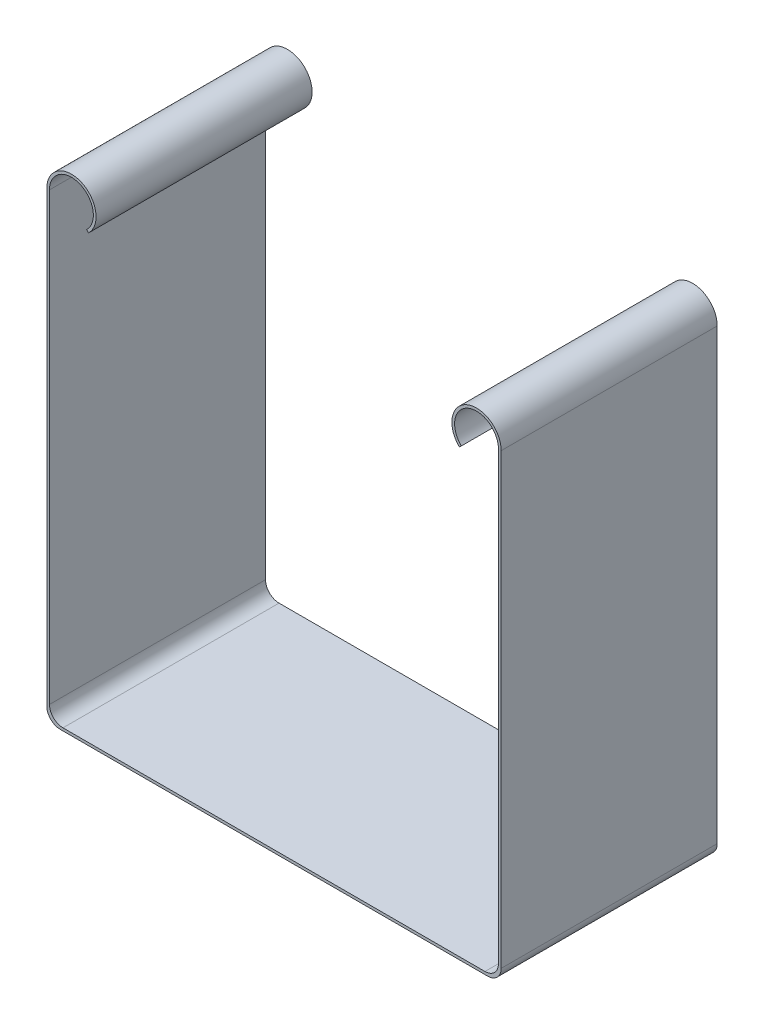
ISO-10303-21;
HEADER;
FILE_DESCRIPTION(('STEP AP214'),'2;1');
FILE_NAME('part.step','',(''),(''),'','','');
FILE_SCHEMA(('AUTOMOTIVE_DESIGN { 1 0 10303 214 1 1 1 1 }'));
ENDSEC;
DATA;
#1=APPLICATION_CONTEXT('core data for automotive mechanical design processes');
#2=APPLICATION_PROTOCOL_DEFINITION('international standard','automotive_design',2000,#1);
#3=PRODUCT_CONTEXT('',#1,'mechanical');
#4=PRODUCT('Part','Part','',(#3));
#5=PRODUCT_RELATED_PRODUCT_CATEGORY('part','',(#4));
#6=PRODUCT_DEFINITION_FORMATION('','',#4);
#7=PRODUCT_DEFINITION_CONTEXT('part definition',#1,'design');
#8=PRODUCT_DEFINITION('design','',#6,#7);
#9=PRODUCT_DEFINITION_SHAPE('','',#8);
#10=(LENGTH_UNIT() NAMED_UNIT(*) SI_UNIT(.MILLI.,.METRE.));
#11=(NAMED_UNIT(*) PLANE_ANGLE_UNIT() SI_UNIT($,.RADIAN.));
#12=(NAMED_UNIT(*) SI_UNIT($,.STERADIAN.) SOLID_ANGLE_UNIT());
#13=UNCERTAINTY_MEASURE_WITH_UNIT(LENGTH_MEASURE(1.E-05),#10,'distance_accuracy_value','');
#14=(GEOMETRIC_REPRESENTATION_CONTEXT(3) GLOBAL_UNCERTAINTY_ASSIGNED_CONTEXT((#13)) GLOBAL_UNIT_ASSIGNED_CONTEXT((#10,
#11,#12)) REPRESENTATION_CONTEXT('',''));
#15=CARTESIAN_POINT('',(0.,0.,0.));
#16=DIRECTION('',(0.,0.,1.));
#17=DIRECTION('',(1.,0.,0.));
#18=AXIS2_PLACEMENT_3D('',#15,#16,#17);
#19=CARTESIAN_POINT('',(33.65,-0.4,32.));
#20=DIRECTION('',(0.,1.,0.));
#21=DIRECTION('',(-1.,0.,0.));
#22=AXIS2_PLACEMENT_3D('',#19,#20,#21);
#23=PLANE('',#22);
#24=DIRECTION('',(1.,0.,0.));
#25=VECTOR('',#24,1.);
#26=CARTESIAN_POINT('',(33.65,-0.4,0.));
#27=LINE('',#26,#25);
#28=CARTESIAN_POINT('',(-31.65,-0.400000000000008,0.));
#29=VERTEX_POINT('',#28);
#30=CARTESIAN_POINT('',(31.65,-0.4,0.));
#31=VERTEX_POINT('',#30);
#32=EDGE_CURVE('E218',#29,#31,#27,.T.);
#33=ORIENTED_EDGE('',*,*,#32,.T.);
#34=DIRECTION('',(0.,0.,-1.));
#35=VECTOR('',#34,1.);
#36=CARTESIAN_POINT('',(31.65,-0.4,32.));
#37=LINE('',#36,#35);
#38=CARTESIAN_POINT('',(31.65,-0.4,32.));
#39=VERTEX_POINT('',#38);
#40=EDGE_CURVE('E48',#31,#39,#37,.F.);
#41=ORIENTED_EDGE('',*,*,#40,.T.);
#42=DIRECTION('',(1.,0.,0.));
#43=VECTOR('',#42,1.);
#44=CARTESIAN_POINT('',(33.65,-0.4,32.));
#45=LINE('',#44,#43);
#46=CARTESIAN_POINT('',(-31.65,-0.400000000000008,32.));
#47=VERTEX_POINT('',#46);
#48=EDGE_CURVE('E219',#47,#39,#45,.T.);
#49=ORIENTED_EDGE('',*,*,#48,.F.);
#50=DIRECTION('',(0.,0.,-1.));
#51=VECTOR('',#50,1.);
#52=CARTESIAN_POINT('',(-31.65,-0.400000000000008,32.));
#53=LINE('',#52,#51);
#54=EDGE_CURVE('E205',#29,#47,#53,.F.);
#55=ORIENTED_EDGE('',*,*,#54,.F.);
#56=EDGE_LOOP('',(#33,#41,#49,#55));
#57=FACE_BOUND('',#56,.T.);
#58=ADVANCED_FACE('F33',(#57),#23,.F.);
#59=CARTESIAN_POINT('',(33.65,68.,32.));
#60=DIRECTION('',(-1.,0.,0.));
#61=DIRECTION('',(0.,0.,1.));
#62=AXIS2_PLACEMENT_3D('',#59,#60,#61);
#63=PLANE('',#62);
#64=DIRECTION('',(0.,1.,0.));
#65=VECTOR('',#64,1.);
#66=CARTESIAN_POINT('',(33.65,34.,32.));
#67=LINE('',#66,#65);
#68=CARTESIAN_POINT('',(33.65,1.6,32.));
#69=VERTEX_POINT('',#68);
#70=CARTESIAN_POINT('',(33.65,68.,32.));
#71=VERTEX_POINT('',#70);
#72=EDGE_CURVE('E221',#69,#71,#67,.T.);
#73=ORIENTED_EDGE('',*,*,#72,.F.);
#74=DIRECTION('',(0.,0.,-1.));
#75=VECTOR('',#74,1.);
#76=CARTESIAN_POINT('',(33.65,1.6,32.));
#77=LINE('',#76,#75);
#78=CARTESIAN_POINT('',(33.65,1.6,0.));
#79=VERTEX_POINT('',#78);
#80=EDGE_CURVE('E266',#69,#79,#77,.T.);
#81=ORIENTED_EDGE('',*,*,#80,.T.);
#82=DIRECTION('',(0.,1.,0.));
#83=VECTOR('',#82,1.);
#84=CARTESIAN_POINT('',(33.65,68.,0.));
#85=LINE('',#84,#83);
#86=CARTESIAN_POINT('',(33.65,68.,0.));
#87=VERTEX_POINT('',#86);
#88=EDGE_CURVE('E237',#79,#87,#85,.T.);
#89=ORIENTED_EDGE('',*,*,#88,.T.);
#90=DIRECTION('',(0.,0.,-1.));
#91=VECTOR('',#90,1.);
#92=CARTESIAN_POINT('',(33.65,68.,32.));
#93=LINE('',#92,#91);
#94=EDGE_CURVE('E258',#71,#87,#93,.T.);
#95=ORIENTED_EDGE('',*,*,#94,.F.);
#96=EDGE_LOOP('',(#73,#81,#89,#95));
#97=FACE_BOUND('',#96,.T.);
#98=ADVANCED_FACE('F306',(#97),#63,.F.);
#99=CARTESIAN_POINT('',(30.,68.,32.));
#100=DIRECTION('',(0.,0.,-1.));
#101=DIRECTION('',(-1.,0.,0.));
#102=AXIS2_PLACEMENT_3D('',#99,#100,#101);
#103=CYLINDRICAL_SURFACE('',#102,3.64999999999999);
#104=CARTESIAN_POINT('',(30.,68.,0.));
#105=DIRECTION('',(0.,0.,1.));
#106=DIRECTION('',(1.,0.,0.));
#107=AXIS2_PLACEMENT_3D('',#104,#105,#106);
#108=CIRCLE('',#107,3.64999999999999);
#109=CARTESIAN_POINT('',(27.4671032395295,65.3718953596178,0.));
#110=VERTEX_POINT('',#109);
#111=EDGE_CURVE('E239',#87,#110,#108,.T.);
#112=ORIENTED_EDGE('',*,*,#111,.T.);
#113=DIRECTION('',(0.,0.,-1.));
#114=VECTOR('',#113,1.);
#115=CARTESIAN_POINT('',(27.4671032395295,65.3718953596178,32.));
#116=LINE('',#115,#114);
#117=CARTESIAN_POINT('',(27.4671032395295,65.3718953596178,32.));
#118=VERTEX_POINT('',#117);
#119=EDGE_CURVE('E255',#118,#110,#116,.T.);
#120=ORIENTED_EDGE('',*,*,#119,.F.);
#121=CARTESIAN_POINT('',(30.,68.,32.));
#122=DIRECTION('',(0.,0.,1.));
#123=DIRECTION('',(1.,0.,0.));
#124=AXIS2_PLACEMENT_3D('',#121,#122,#123);
#125=CIRCLE('',#124,3.64999999999999);
#126=EDGE_CURVE('E224',#71,#118,#125,.T.);
#127=ORIENTED_EDGE('',*,*,#126,.F.);
#128=ORIENTED_EDGE('',*,*,#94,.T.);
#129=EDGE_LOOP('',(#112,#120,#127,#128));
#130=FACE_BOUND('',#129,.T.);
#131=ADVANCED_FACE('F302',(#130),#103,.T.);
#132=CARTESIAN_POINT('',(27.75,65.6547921200883,32.));
#133=DIRECTION('',(-0.707106781186561,0.707106781186535,0.));
#134=DIRECTION('',(-0.707106781186535,-0.707106781186561,0.));
#135=AXIS2_PLACEMENT_3D('',#132,#133,#134);
#136=PLANE('',#135);
#137=DIRECTION('',(0.707106781186534,0.70710678118656,0.));
#138=VECTOR('',#137,1.);
#139=CARTESIAN_POINT('',(27.75,65.6547921200883,0.));
#140=LINE('',#139,#138);
#141=CARTESIAN_POINT('',(27.75,65.6547921200883,0.));
#142=VERTEX_POINT('',#141);
#143=EDGE_CURVE('E241',#110,#142,#140,.T.);
#144=ORIENTED_EDGE('',*,*,#143,.T.);
#145=DIRECTION('',(0.,0.,-1.));
#146=VECTOR('',#145,1.);
#147=CARTESIAN_POINT('',(27.75,65.6547921200883,32.));
#148=LINE('',#147,#146);
#149=CARTESIAN_POINT('',(27.75,65.6547921200883,32.));
#150=VERTEX_POINT('',#149);
#151=EDGE_CURVE('E252',#150,#142,#148,.T.);
#152=ORIENTED_EDGE('',*,*,#151,.F.);
#153=DIRECTION('',(0.707106781186534,0.70710678118656,0.));
#154=VECTOR('',#153,1.);
#155=CARTESIAN_POINT('',(27.75,65.6547921200883,32.));
#156=LINE('',#155,#154);
#157=EDGE_CURVE('E226',#118,#150,#156,.T.);
#158=ORIENTED_EDGE('',*,*,#157,.F.);
#159=ORIENTED_EDGE('',*,*,#119,.T.);
#160=EDGE_LOOP('',(#144,#152,#158,#159));
#161=FACE_BOUND('',#160,.T.);
#162=ADVANCED_FACE('F297',(#161),#136,.F.);
#163=CARTESIAN_POINT('',(30.,68.,32.));
#164=DIRECTION('',(0.,0.,-1.));
#165=DIRECTION('',(-1.,0.,0.));
#166=AXIS2_PLACEMENT_3D('',#163,#164,#165);
#167=CYLINDRICAL_SURFACE('',#166,3.24999999999999);
#168=CARTESIAN_POINT('',(30.,68.,0.));
#169=DIRECTION('',(0.,0.,-1.));
#170=DIRECTION('',(1.,0.,0.));
#171=AXIS2_PLACEMENT_3D('',#168,#169,#170);
#172=CIRCLE('',#171,3.24999999999999);
#173=CARTESIAN_POINT('',(33.25,68.,0.));
#174=VERTEX_POINT('',#173);
#175=EDGE_CURVE('E243',#142,#174,#172,.T.);
#176=ORIENTED_EDGE('',*,*,#175,.T.);
#177=DIRECTION('',(0.,0.,-1.));
#178=VECTOR('',#177,1.);
#179=CARTESIAN_POINT('',(33.25,68.,32.));
#180=LINE('',#179,#178);
#181=CARTESIAN_POINT('',(33.25,68.,32.));
#182=VERTEX_POINT('',#181);
#183=EDGE_CURVE('E235',#182,#174,#180,.T.);
#184=ORIENTED_EDGE('',*,*,#183,.F.);
#185=CARTESIAN_POINT('',(30.,68.,32.));
#186=DIRECTION('',(0.,0.,-1.));
#187=DIRECTION('',(1.,0.,0.));
#188=AXIS2_PLACEMENT_3D('',#185,#186,#187);
#189=CIRCLE('',#188,3.24999999999999);
#190=EDGE_CURVE('E228',#150,#182,#189,.T.);
#191=ORIENTED_EDGE('',*,*,#190,.F.);
#192=ORIENTED_EDGE('',*,*,#151,.T.);
#193=EDGE_LOOP('',(#176,#184,#191,#192));
#194=FACE_BOUND('',#193,.T.);
#195=ADVANCED_FACE('F292',(#194),#167,.F.);
#196=CARTESIAN_POINT('',(33.25,34.,32.));
#197=DIRECTION('',(1.,0.,0.));
#198=DIRECTION('',(0.,0.,-1.));
#199=AXIS2_PLACEMENT_3D('',#196,#197,#198);
#200=PLANE('',#199);
#201=DIRECTION('',(0.,-1.,0.));
#202=VECTOR('',#201,1.);
#203=CARTESIAN_POINT('',(33.25,34.,0.));
#204=LINE('',#203,#202);
#205=CARTESIAN_POINT('',(33.25,2.,0.));
#206=VERTEX_POINT('',#205);
#207=EDGE_CURVE('E246',#174,#206,#204,.T.);
#208=ORIENTED_EDGE('',*,*,#207,.T.);
#209=DIRECTION('',(0.,0.,-1.));
#210=VECTOR('',#209,1.);
#211=CARTESIAN_POINT('',(33.25,2.,32.));
#212=LINE('',#211,#210);
#213=CARTESIAN_POINT('',(33.25,2.,32.));
#214=VERTEX_POINT('',#213);
#215=EDGE_CURVE('E264',#206,#214,#212,.F.);
#216=ORIENTED_EDGE('',*,*,#215,.T.);
#217=DIRECTION('',(0.,-1.,0.));
#218=VECTOR('',#217,1.);
#219=CARTESIAN_POINT('',(33.25,68.,32.));
#220=LINE('',#219,#218);
#221=EDGE_CURVE('E230',#182,#214,#220,.T.);
#222=ORIENTED_EDGE('',*,*,#221,.F.);
#223=ORIENTED_EDGE('',*,*,#183,.T.);
#224=EDGE_LOOP('',(#208,#216,#222,#223));
#225=FACE_BOUND('',#224,.T.);
#226=ADVANCED_FACE('F288',(#225),#200,.F.);
#227=CARTESIAN_POINT('',(33.25,0.,32.));
#228=DIRECTION('',(0.,-1.,0.));
#229=DIRECTION('',(0.,0.,-1.));
#230=AXIS2_PLACEMENT_3D('',#227,#228,#229);
#231=PLANE('',#230);
#232=DIRECTION('',(-1.,0.,0.));
#233=VECTOR('',#232,1.);
#234=CARTESIAN_POINT('',(33.25,0.,32.));
#235=LINE('',#234,#233);
#236=CARTESIAN_POINT('',(31.25,0.,32.));
#237=VERTEX_POINT('',#236);
#238=CARTESIAN_POINT('',(-31.25,0.,32.));
#239=VERTEX_POINT('',#238);
#240=EDGE_CURVE('E233',#237,#239,#235,.T.);
#241=ORIENTED_EDGE('',*,*,#240,.F.);
#242=DIRECTION('',(0.,0.,-1.));
#243=VECTOR('',#242,1.);
#244=CARTESIAN_POINT('',(31.25,0.,0.));
#245=LINE('',#244,#243);
#246=CARTESIAN_POINT('',(31.25,0.,0.));
#247=VERTEX_POINT('',#246);
#248=EDGE_CURVE('E261',#237,#247,#245,.T.);
#249=ORIENTED_EDGE('',*,*,#248,.T.);
#250=DIRECTION('',(-1.,0.,0.));
#251=VECTOR('',#250,1.);
#252=CARTESIAN_POINT('',(33.25,0.,0.));
#253=LINE('',#252,#251);
#254=CARTESIAN_POINT('',(-31.25,0.,0.));
#255=VERTEX_POINT('',#254);
#256=EDGE_CURVE('E222',#247,#255,#253,.T.);
#257=ORIENTED_EDGE('',*,*,#256,.T.);
#258=DIRECTION('',(0.,0.,-1.));
#259=VECTOR('',#258,1.);
#260=CARTESIAN_POINT('',(-31.25,0.,0.));
#261=LINE('',#260,#259);
#262=EDGE_CURVE('E164',#239,#255,#261,.T.);
#263=ORIENTED_EDGE('',*,*,#262,.F.);
#264=EDGE_LOOP('',(#241,#249,#257,#263));
#265=FACE_BOUND('',#264,.T.);
#266=ADVANCED_FACE('F281',(#265),#231,.F.);
#267=CARTESIAN_POINT('',(30.,68.,32.));
#268=DIRECTION('',(0.,0.,1.));
#269=DIRECTION('',(1.,0.,0.));
#270=AXIS2_PLACEMENT_3D('',#267,#268,#269);
#271=PLANE('',#270);
#272=ORIENTED_EDGE('',*,*,#48,.T.);
#273=CARTESIAN_POINT('',(31.65,1.6,32.));
#274=DIRECTION('',(0.,0.,1.));
#275=DIRECTION('',(1.,0.,0.));
#276=AXIS2_PLACEMENT_3D('',#273,#274,#275);
#277=CIRCLE('',#276,2.);
#278=EDGE_CURVE('E11',#39,#69,#277,.T.);
#279=ORIENTED_EDGE('',*,*,#278,.T.);
#280=ORIENTED_EDGE('',*,*,#72,.T.);
#281=ORIENTED_EDGE('',*,*,#126,.T.);
#282=ORIENTED_EDGE('',*,*,#157,.T.);
#283=ORIENTED_EDGE('',*,*,#190,.T.);
#284=ORIENTED_EDGE('',*,*,#221,.T.);
#285=CARTESIAN_POINT('',(31.25,2.,32.));
#286=DIRECTION('',(0.,0.,1.));
#287=DIRECTION('',(1.,0.,0.));
#288=AXIS2_PLACEMENT_3D('',#285,#286,#287);
#289=CIRCLE('',#288,2.);
#290=EDGE_CURVE('E272',#214,#237,#289,.F.);
#291=ORIENTED_EDGE('',*,*,#290,.T.);
#292=ORIENTED_EDGE('',*,*,#240,.T.);
#293=CARTESIAN_POINT('',(-31.25,1.99999999999999,32.));
#294=DIRECTION('',(0.,0.,-1.));
#295=DIRECTION('',(-1.,0.,0.));
#296=AXIS2_PLACEMENT_3D('',#293,#294,#295);
#297=CIRCLE('',#296,2.);
#298=CARTESIAN_POINT('',(-33.25,1.99999999999999,32.));
#299=VERTEX_POINT('',#298);
#300=EDGE_CURVE('E210',#299,#239,#297,.F.);
#301=ORIENTED_EDGE('',*,*,#300,.F.);
#302=DIRECTION('',(0.,-1.,0.));
#303=VECTOR('',#302,1.);
#304=CARTESIAN_POINT('',(-33.25,68.,32.));
#305=LINE('',#304,#303);
#306=CARTESIAN_POINT('',(-33.25,68.,32.));
#307=VERTEX_POINT('',#306);
#308=EDGE_CURVE('E181',#307,#299,#305,.T.);
#309=ORIENTED_EDGE('',*,*,#308,.F.);
#310=CARTESIAN_POINT('',(-30.,68.,32.));
#311=DIRECTION('',(0.,0.,1.));
#312=DIRECTION('',(-1.,0.,0.));
#313=AXIS2_PLACEMENT_3D('',#310,#311,#312);
#314=CIRCLE('',#313,3.24999999999999);
#315=CARTESIAN_POINT('',(-27.75,65.6547921200883,32.));
#316=VERTEX_POINT('',#315);
#317=EDGE_CURVE('E178',#316,#307,#314,.T.);
#318=ORIENTED_EDGE('',*,*,#317,.F.);
#319=DIRECTION('',(-0.707106781186535,0.70710678118656,0.));
#320=VECTOR('',#319,1.);
#321=CARTESIAN_POINT('',(-27.75,65.6547921200883,32.));
#322=LINE('',#321,#320);
#323=CARTESIAN_POINT('',(-27.4671032395296,65.3718953596178,32.));
#324=VERTEX_POINT('',#323);
#325=EDGE_CURVE('E151',#324,#316,#322,.T.);
#326=ORIENTED_EDGE('',*,*,#325,.F.);
#327=CARTESIAN_POINT('',(-30.,68.,32.));
#328=DIRECTION('',(0.,0.,-1.));
#329=DIRECTION('',(-1.,0.,0.));
#330=AXIS2_PLACEMENT_3D('',#327,#328,#329);
#331=CIRCLE('',#330,3.64999999999999);
#332=CARTESIAN_POINT('',(-33.65,68.,32.));
#333=VERTEX_POINT('',#332);
#334=EDGE_CURVE('E144',#333,#324,#331,.T.);
#335=ORIENTED_EDGE('',*,*,#334,.F.);
#336=DIRECTION('',(0.,1.,0.));
#337=VECTOR('',#336,1.);
#338=CARTESIAN_POINT('',(-33.65,34.,32.));
#339=LINE('',#338,#337);
#340=CARTESIAN_POINT('',(-33.65,1.6,32.));
#341=VERTEX_POINT('',#340);
#342=EDGE_CURVE('E149',#341,#333,#339,.T.);
#343=ORIENTED_EDGE('',*,*,#342,.F.);
#344=CARTESIAN_POINT('',(-31.65,1.6,32.));
#345=DIRECTION('',(0.,0.,-1.));
#346=DIRECTION('',(-1.,0.,0.));
#347=AXIS2_PLACEMENT_3D('',#344,#345,#346);
#348=CIRCLE('',#347,2.);
#349=EDGE_CURVE('E216',#47,#341,#348,.T.);
#350=ORIENTED_EDGE('',*,*,#349,.F.);
#351=EDGE_LOOP('',(#272,#279,#280,#281,#282,#283,#284,#291,#292,#301,#309,#318,#326,#335,#343,#350));
#352=FACE_BOUND('',#351,.T.);
#353=ADVANCED_FACE('F146',(#352),#271,.T.);
#354=CARTESIAN_POINT('',(30.,68.,0.));
#355=DIRECTION('',(0.,0.,1.));
#356=DIRECTION('',(1.,0.,0.));
#357=AXIS2_PLACEMENT_3D('',#354,#355,#356);
#358=PLANE('',#357);
#359=ORIENTED_EDGE('',*,*,#88,.F.);
#360=CARTESIAN_POINT('',(31.65,1.6,0.));
#361=DIRECTION('',(0.,0.,1.));
#362=DIRECTION('',(1.,0.,0.));
#363=AXIS2_PLACEMENT_3D('',#360,#361,#362);
#364=CIRCLE('',#363,2.);
#365=EDGE_CURVE('E41',#79,#31,#364,.F.);
#366=ORIENTED_EDGE('',*,*,#365,.T.);
#367=ORIENTED_EDGE('',*,*,#32,.F.);
#368=CARTESIAN_POINT('',(-31.65,1.6,0.));
#369=DIRECTION('',(0.,0.,-1.));
#370=DIRECTION('',(-1.,0.,0.));
#371=AXIS2_PLACEMENT_3D('',#368,#369,#370);
#372=CIRCLE('',#371,2.);
#373=CARTESIAN_POINT('',(-33.65,1.6,0.));
#374=VERTEX_POINT('',#373);
#375=EDGE_CURVE('E213',#374,#29,#372,.F.);
#376=ORIENTED_EDGE('',*,*,#375,.F.);
#377=DIRECTION('',(0.,1.,0.));
#378=VECTOR('',#377,1.);
#379=CARTESIAN_POINT('',(-33.65,68.,0.));
#380=LINE('',#379,#378);
#381=CARTESIAN_POINT('',(-33.65,68.,0.));
#382=VERTEX_POINT('',#381);
#383=EDGE_CURVE('E185',#374,#382,#380,.T.);
#384=ORIENTED_EDGE('',*,*,#383,.T.);
#385=CARTESIAN_POINT('',(-30.,68.,0.));
#386=DIRECTION('',(0.,0.,-1.));
#387=DIRECTION('',(-1.,0.,0.));
#388=AXIS2_PLACEMENT_3D('',#385,#386,#387);
#389=CIRCLE('',#388,3.64999999999999);
#390=CARTESIAN_POINT('',(-27.4671032395296,65.3718953596178,0.));
#391=VERTEX_POINT('',#390);
#392=EDGE_CURVE('E160',#382,#391,#389,.T.);
#393=ORIENTED_EDGE('',*,*,#392,.T.);
#394=DIRECTION('',(-0.707106781186535,0.70710678118656,0.));
#395=VECTOR('',#394,1.);
#396=CARTESIAN_POINT('',(-27.75,65.6547921200883,0.));
#397=LINE('',#396,#395);
#398=CARTESIAN_POINT('',(-27.75,65.6547921200883,0.));
#399=VERTEX_POINT('',#398);
#400=EDGE_CURVE('E188',#391,#399,#397,.T.);
#401=ORIENTED_EDGE('',*,*,#400,.T.);
#402=CARTESIAN_POINT('',(-30.,68.,0.));
#403=DIRECTION('',(0.,0.,1.));
#404=DIRECTION('',(-1.,0.,0.));
#405=AXIS2_PLACEMENT_3D('',#402,#403,#404);
#406=CIRCLE('',#405,3.24999999999999);
#407=CARTESIAN_POINT('',(-33.25,68.,0.));
#408=VERTEX_POINT('',#407);
#409=EDGE_CURVE('E174',#399,#408,#406,.T.);
#410=ORIENTED_EDGE('',*,*,#409,.T.);
#411=DIRECTION('',(0.,-1.,0.));
#412=VECTOR('',#411,1.);
#413=CARTESIAN_POINT('',(-33.25,34.,0.));
#414=LINE('',#413,#412);
#415=CARTESIAN_POINT('',(-33.25,1.99999999999999,0.));
#416=VERTEX_POINT('',#415);
#417=EDGE_CURVE('E171',#408,#416,#414,.T.);
#418=ORIENTED_EDGE('',*,*,#417,.T.);
#419=CARTESIAN_POINT('',(-31.25,1.99999999999999,0.));
#420=DIRECTION('',(0.,0.,-1.));
#421=DIRECTION('',(-1.,0.,0.));
#422=AXIS2_PLACEMENT_3D('',#419,#420,#421);
#423=CIRCLE('',#422,2.);
#424=EDGE_CURVE('E208',#255,#416,#423,.T.);
#425=ORIENTED_EDGE('',*,*,#424,.F.);
#426=ORIENTED_EDGE('',*,*,#256,.F.);
#427=CARTESIAN_POINT('',(31.25,2.,0.));
#428=DIRECTION('',(0.,0.,1.));
#429=DIRECTION('',(1.,0.,0.));
#430=AXIS2_PLACEMENT_3D('',#427,#428,#429);
#431=CIRCLE('',#430,2.);
#432=EDGE_CURVE('E270',#247,#206,#431,.T.);
#433=ORIENTED_EDGE('',*,*,#432,.T.);
#434=ORIENTED_EDGE('',*,*,#207,.F.);
#435=ORIENTED_EDGE('',*,*,#175,.F.);
#436=ORIENTED_EDGE('',*,*,#143,.F.);
#437=ORIENTED_EDGE('',*,*,#111,.F.);
#438=EDGE_LOOP('',(#359,#366,#367,#376,#384,#393,#401,#410,#418,#425,#426,#433,#434,#435,#436,#437));
#439=FACE_BOUND('',#438,.T.);
#440=ADVANCED_FACE('F284',(#439),#358,.F.);
#441=CARTESIAN_POINT('',(31.25,2.,32.));
#442=DIRECTION('',(0.,0.,1.));
#443=DIRECTION('',(1.,0.,0.));
#444=AXIS2_PLACEMENT_3D('',#441,#442,#443);
#445=CYLINDRICAL_SURFACE('',#444,2.);
#446=ORIENTED_EDGE('',*,*,#290,.F.);
#447=ORIENTED_EDGE('',*,*,#215,.F.);
#448=ORIENTED_EDGE('',*,*,#432,.F.);
#449=ORIENTED_EDGE('',*,*,#248,.F.);
#450=EDGE_LOOP('',(#446,#447,#448,#449));
#451=FACE_BOUND('',#450,.T.);
#452=ADVANCED_FACE('F283',(#451),#445,.F.);
#453=CARTESIAN_POINT('',(31.65,1.6,32.));
#454=DIRECTION('',(0.,0.,-1.));
#455=DIRECTION('',(-1.,0.,0.));
#456=AXIS2_PLACEMENT_3D('',#453,#454,#455);
#457=CYLINDRICAL_SURFACE('',#456,2.);
#458=ORIENTED_EDGE('',*,*,#278,.F.);
#459=ORIENTED_EDGE('',*,*,#40,.F.);
#460=ORIENTED_EDGE('',*,*,#365,.F.);
#461=ORIENTED_EDGE('',*,*,#80,.F.);
#462=EDGE_LOOP('',(#458,#459,#460,#461));
#463=FACE_BOUND('',#462,.T.);
#464=ADVANCED_FACE('F35',(#463),#457,.T.);
#465=CARTESIAN_POINT('',(-33.65,68.,32.));
#466=DIRECTION('',(1.,0.,0.));
#467=DIRECTION('',(0.,0.,1.));
#468=AXIS2_PLACEMENT_3D('',#465,#466,#467);
#469=PLANE('',#468);
#470=ORIENTED_EDGE('',*,*,#342,.T.);
#471=DIRECTION('',(0.,0.,-1.));
#472=VECTOR('',#471,1.);
#473=CARTESIAN_POINT('',(-33.65,68.,32.));
#474=LINE('',#473,#472);
#475=EDGE_CURVE('E157',#333,#382,#474,.T.);
#476=ORIENTED_EDGE('',*,*,#475,.T.);
#477=ORIENTED_EDGE('',*,*,#383,.F.);
#478=DIRECTION('',(0.,0.,-1.));
#479=VECTOR('',#478,1.);
#480=CARTESIAN_POINT('',(-33.65,1.6,32.));
#481=LINE('',#480,#479);
#482=EDGE_CURVE('E170',#341,#374,#481,.T.);
#483=ORIENTED_EDGE('',*,*,#482,.F.);
#484=EDGE_LOOP('',(#470,#476,#477,#483));
#485=FACE_BOUND('',#484,.T.);
#486=ADVANCED_FACE('F168',(#485),#469,.F.);
#487=CARTESIAN_POINT('',(-30.,68.,32.));
#488=DIRECTION('',(0.,0.,-1.));
#489=DIRECTION('',(1.,0.,0.));
#490=AXIS2_PLACEMENT_3D('',#487,#488,#489);
#491=CYLINDRICAL_SURFACE('',#490,3.64999999999999);
#492=ORIENTED_EDGE('',*,*,#392,.F.);
#493=ORIENTED_EDGE('',*,*,#475,.F.);
#494=ORIENTED_EDGE('',*,*,#334,.T.);
#495=DIRECTION('',(0.,0.,-1.));
#496=VECTOR('',#495,1.);
#497=CARTESIAN_POINT('',(-27.4671032395296,65.3718953596178,32.));
#498=LINE('',#497,#496);
#499=EDGE_CURVE('E165',#324,#391,#498,.T.);
#500=ORIENTED_EDGE('',*,*,#499,.T.);
#501=EDGE_LOOP('',(#492,#493,#494,#500));
#502=FACE_BOUND('',#501,.T.);
#503=ADVANCED_FACE('F158',(#502),#491,.T.);
#504=CARTESIAN_POINT('',(-27.75,65.6547921200883,32.));
#505=DIRECTION('',(0.70710678118656,0.707106781186535,0.));
#506=DIRECTION('',(0.707106781186535,-0.70710678118656,0.));
#507=AXIS2_PLACEMENT_3D('',#504,#505,#506);
#508=PLANE('',#507);
#509=ORIENTED_EDGE('',*,*,#400,.F.);
#510=ORIENTED_EDGE('',*,*,#499,.F.);
#511=ORIENTED_EDGE('',*,*,#325,.T.);
#512=DIRECTION('',(0.,0.,-1.));
#513=VECTOR('',#512,1.);
#514=CARTESIAN_POINT('',(-27.75,65.6547921200883,32.));
#515=LINE('',#514,#513);
#516=EDGE_CURVE('E195',#316,#399,#515,.T.);
#517=ORIENTED_EDGE('',*,*,#516,.T.);
#518=EDGE_LOOP('',(#509,#510,#511,#517));
#519=FACE_BOUND('',#518,.T.);
#520=ADVANCED_FACE('F314',(#519),#508,.F.);
#521=CARTESIAN_POINT('',(-30.,68.,32.));
#522=DIRECTION('',(0.,0.,-1.));
#523=DIRECTION('',(1.,0.,0.));
#524=AXIS2_PLACEMENT_3D('',#521,#522,#523);
#525=CYLINDRICAL_SURFACE('',#524,3.24999999999999);
#526=ORIENTED_EDGE('',*,*,#409,.F.);
#527=ORIENTED_EDGE('',*,*,#516,.F.);
#528=ORIENTED_EDGE('',*,*,#317,.T.);
#529=DIRECTION('',(0.,0.,-1.));
#530=VECTOR('',#529,1.);
#531=CARTESIAN_POINT('',(-33.25,68.,32.));
#532=LINE('',#531,#530);
#533=EDGE_CURVE('E184',#307,#408,#532,.T.);
#534=ORIENTED_EDGE('',*,*,#533,.T.);
#535=EDGE_LOOP('',(#526,#527,#528,#534));
#536=FACE_BOUND('',#535,.T.);
#537=ADVANCED_FACE('F317',(#536),#525,.F.);
#538=CARTESIAN_POINT('',(-33.25,34.,32.));
#539=DIRECTION('',(-1.,0.,0.));
#540=DIRECTION('',(0.,0.,-1.));
#541=AXIS2_PLACEMENT_3D('',#538,#539,#540);
#542=PLANE('',#541);
#543=ORIENTED_EDGE('',*,*,#417,.F.);
#544=ORIENTED_EDGE('',*,*,#533,.F.);
#545=ORIENTED_EDGE('',*,*,#308,.T.);
#546=DIRECTION('',(0.,0.,-1.));
#547=VECTOR('',#546,1.);
#548=CARTESIAN_POINT('',(-33.25,1.99999999999999,32.));
#549=LINE('',#548,#547);
#550=EDGE_CURVE('E201',#416,#299,#549,.F.);
#551=ORIENTED_EDGE('',*,*,#550,.F.);
#552=EDGE_LOOP('',(#543,#544,#545,#551));
#553=FACE_BOUND('',#552,.T.);
#554=ADVANCED_FACE('F320',(#553),#542,.F.);
#555=CARTESIAN_POINT('',(-31.25,1.99999999999999,32.));
#556=DIRECTION('',(0.,0.,1.));
#557=DIRECTION('',(-1.,0.,0.));
#558=AXIS2_PLACEMENT_3D('',#555,#556,#557);
#559=CYLINDRICAL_SURFACE('',#558,2.);
#560=ORIENTED_EDGE('',*,*,#300,.T.);
#561=ORIENTED_EDGE('',*,*,#262,.T.);
#562=ORIENTED_EDGE('',*,*,#424,.T.);
#563=ORIENTED_EDGE('',*,*,#550,.T.);
#564=EDGE_LOOP('',(#560,#561,#562,#563));
#565=FACE_BOUND('',#564,.T.);
#566=ADVANCED_FACE('F323',(#565),#559,.F.);
#567=CARTESIAN_POINT('',(-31.65,1.6,32.));
#568=DIRECTION('',(0.,0.,-1.));
#569=DIRECTION('',(1.,0.,0.));
#570=AXIS2_PLACEMENT_3D('',#567,#568,#569);
#571=CYLINDRICAL_SURFACE('',#570,2.);
#572=ORIENTED_EDGE('',*,*,#349,.T.);
#573=ORIENTED_EDGE('',*,*,#482,.T.);
#574=ORIENTED_EDGE('',*,*,#375,.T.);
#575=ORIENTED_EDGE('',*,*,#54,.T.);
#576=EDGE_LOOP('',(#572,#573,#574,#575));
#577=FACE_BOUND('',#576,.T.);
#578=ADVANCED_FACE('F312',(#577),#571,.T.);
#579=CLOSED_SHELL('',(#58,#98,#131,#162,#195,#226,#266,#353,#440,#452,#464,#486,#503,#520,#537,
#554,#566,#578));
#580=MANIFOLD_SOLID_BREP('B2',#579);
#581=ADVANCED_BREP_SHAPE_REPRESENTATION('',(#18,#580),#14);
#582=SHAPE_DEFINITION_REPRESENTATION(#9,#581);
ENDSEC;
END-ISO-10303-21;
